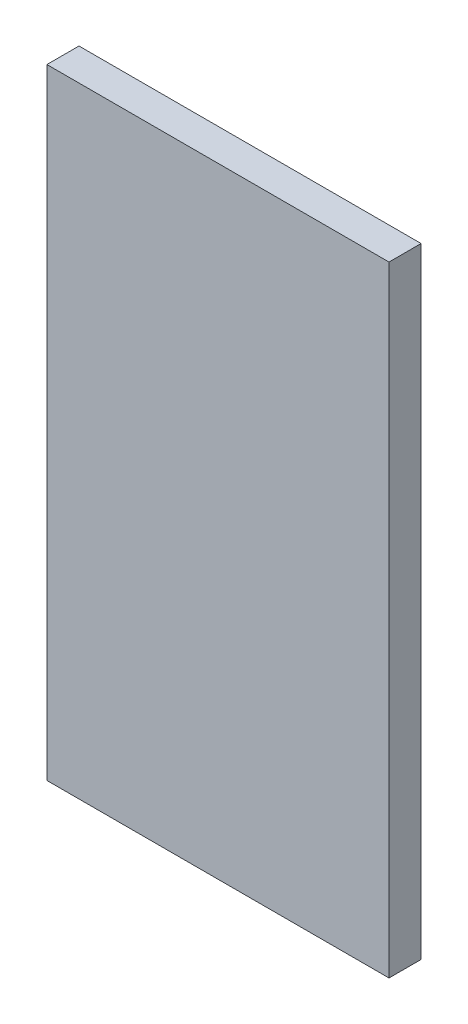
ISO-10303-21;
HEADER;
FILE_DESCRIPTION(('STEP AP214'),'2;1');
FILE_NAME('part.step','',(''),(''),'','','');
FILE_SCHEMA(('AUTOMOTIVE_DESIGN { 1 0 10303 214 1 1 1 1 }'));
ENDSEC;
DATA;
#1=APPLICATION_CONTEXT('core data for automotive mechanical design processes');
#2=APPLICATION_PROTOCOL_DEFINITION('international standard','automotive_design',2000,#1);
#3=PRODUCT_CONTEXT('',#1,'mechanical');
#4=PRODUCT('Part','Part','',(#3));
#5=PRODUCT_RELATED_PRODUCT_CATEGORY('part','',(#4));
#6=PRODUCT_DEFINITION_FORMATION('','',#4);
#7=PRODUCT_DEFINITION_CONTEXT('part definition',#1,'design');
#8=PRODUCT_DEFINITION('design','',#6,#7);
#9=PRODUCT_DEFINITION_SHAPE('','',#8);
#10=(LENGTH_UNIT() NAMED_UNIT(*) SI_UNIT(.MILLI.,.METRE.));
#11=(NAMED_UNIT(*) PLANE_ANGLE_UNIT() SI_UNIT($,.RADIAN.));
#12=(NAMED_UNIT(*) SI_UNIT($,.STERADIAN.) SOLID_ANGLE_UNIT());
#13=UNCERTAINTY_MEASURE_WITH_UNIT(LENGTH_MEASURE(1.E-05),#10,'distance_accuracy_value','');
#14=(GEOMETRIC_REPRESENTATION_CONTEXT(3) GLOBAL_UNCERTAINTY_ASSIGNED_CONTEXT((#13)) GLOBAL_UNIT_ASSIGNED_CONTEXT((#10,
#11,#12)) REPRESENTATION_CONTEXT('',''));
#15=CARTESIAN_POINT('',(0.,0.,0.));
#16=DIRECTION('',(0.,0.,1.));
#17=DIRECTION('',(1.,0.,0.));
#18=AXIS2_PLACEMENT_3D('',#15,#16,#17);
#19=CARTESIAN_POINT('',(0.,0.,3.));
#20=DIRECTION('',(1.,0.,0.));
#21=DIRECTION('',(0.,0.,-1.));
#22=AXIS2_PLACEMENT_3D('',#19,#20,#21);
#23=PLANE('',#22);
#24=DIRECTION('',(0.,-1.,0.));
#25=VECTOR('',#24,1.);
#26=CARTESIAN_POINT('',(0.,0.,0.));
#27=LINE('',#26,#25);
#28=CARTESIAN_POINT('',(0.,0.,0.));
#29=VERTEX_POINT('',#28);
#30=CARTESIAN_POINT('',(0.,-58.,0.));
#31=VERTEX_POINT('',#30);
#32=EDGE_CURVE('E96',#29,#31,#27,.T.);
#33=ORIENTED_EDGE('',*,*,#32,.T.);
#34=DIRECTION('',(0.,0.,-1.));
#35=VECTOR('',#34,1.);
#36=CARTESIAN_POINT('',(0.,-58.,3.));
#37=LINE('',#36,#35);
#38=CARTESIAN_POINT('',(0.,-58.,3.));
#39=VERTEX_POINT('',#38);
#40=EDGE_CURVE('E11',#39,#31,#37,.T.);
#41=ORIENTED_EDGE('',*,*,#40,.F.);
#42=DIRECTION('',(0.,-1.,0.));
#43=VECTOR('',#42,1.);
#44=CARTESIAN_POINT('',(0.,0.,3.));
#45=LINE('',#44,#43);
#46=CARTESIAN_POINT('',(0.,0.,3.));
#47=VERTEX_POINT('',#46);
#48=EDGE_CURVE('E84',#47,#39,#45,.T.);
#49=ORIENTED_EDGE('',*,*,#48,.F.);
#50=DIRECTION('',(0.,0.,-1.));
#51=VECTOR('',#50,1.);
#52=CARTESIAN_POINT('',(0.,0.,3.));
#53=LINE('',#52,#51);
#54=EDGE_CURVE('E92',#47,#29,#53,.T.);
#55=ORIENTED_EDGE('',*,*,#54,.T.);
#56=EDGE_LOOP('',(#33,#41,#49,#55));
#57=FACE_BOUND('',#56,.T.);
#58=ADVANCED_FACE('F33',(#57),#23,.F.);
#59=CARTESIAN_POINT('',(0.,-58.,3.));
#60=DIRECTION('',(0.,1.,0.));
#61=DIRECTION('',(0.,0.,1.));
#62=AXIS2_PLACEMENT_3D('',#59,#60,#61);
#63=PLANE('',#62);
#64=DIRECTION('',(1.,0.,0.));
#65=VECTOR('',#64,1.);
#66=CARTESIAN_POINT('',(0.,-58.,0.));
#67=LINE('',#66,#65);
#68=CARTESIAN_POINT('',(32.,-58.,0.));
#69=VERTEX_POINT('',#68);
#70=EDGE_CURVE('E88',#31,#69,#67,.T.);
#71=ORIENTED_EDGE('',*,*,#70,.T.);
#72=DIRECTION('',(0.,0.,-1.));
#73=VECTOR('',#72,1.);
#74=CARTESIAN_POINT('',(32.,-58.,3.));
#75=LINE('',#74,#73);
#76=CARTESIAN_POINT('',(32.,-58.,3.));
#77=VERTEX_POINT('',#76);
#78=EDGE_CURVE('E41',#77,#69,#75,.T.);
#79=ORIENTED_EDGE('',*,*,#78,.F.);
#80=DIRECTION('',(1.,0.,0.));
#81=VECTOR('',#80,1.);
#82=CARTESIAN_POINT('',(0.,-58.,3.));
#83=LINE('',#82,#81);
#84=EDGE_CURVE('E79',#39,#77,#83,.T.);
#85=ORIENTED_EDGE('',*,*,#84,.F.);
#86=ORIENTED_EDGE('',*,*,#40,.T.);
#87=EDGE_LOOP('',(#71,#79,#85,#86));
#88=FACE_BOUND('',#87,.T.);
#89=ADVANCED_FACE('F87',(#88),#63,.F.);
#90=CARTESIAN_POINT('',(32.,0.,3.));
#91=DIRECTION('',(-1.,0.,0.));
#92=DIRECTION('',(0.,-1.,0.));
#93=AXIS2_PLACEMENT_3D('',#90,#91,#92);
#94=PLANE('',#93);
#95=DIRECTION('',(0.,1.,0.));
#96=VECTOR('',#95,1.);
#97=CARTESIAN_POINT('',(32.,0.,0.));
#98=LINE('',#97,#96);
#99=CARTESIAN_POINT('',(32.,0.,0.));
#100=VERTEX_POINT('',#99);
#101=EDGE_CURVE('E66',#69,#100,#98,.T.);
#102=ORIENTED_EDGE('',*,*,#101,.T.);
#103=DIRECTION('',(0.,0.,-1.));
#104=VECTOR('',#103,1.);
#105=CARTESIAN_POINT('',(32.,0.,3.));
#106=LINE('',#105,#104);
#107=CARTESIAN_POINT('',(32.,0.,3.));
#108=VERTEX_POINT('',#107);
#109=EDGE_CURVE('E89',#108,#100,#106,.T.);
#110=ORIENTED_EDGE('',*,*,#109,.F.);
#111=DIRECTION('',(0.,1.,0.));
#112=VECTOR('',#111,1.);
#113=CARTESIAN_POINT('',(32.,0.,3.));
#114=LINE('',#113,#112);
#115=EDGE_CURVE('E82',#77,#108,#114,.T.);
#116=ORIENTED_EDGE('',*,*,#115,.F.);
#117=ORIENTED_EDGE('',*,*,#78,.T.);
#118=EDGE_LOOP('',(#102,#110,#116,#117));
#119=FACE_BOUND('',#118,.T.);
#120=ADVANCED_FACE('F90',(#119),#94,.F.);
#121=CARTESIAN_POINT('',(0.,0.,3.));
#122=DIRECTION('',(0.,-1.,0.));
#123=DIRECTION('',(0.,0.,-1.));
#124=AXIS2_PLACEMENT_3D('',#121,#122,#123);
#125=PLANE('',#124);
#126=DIRECTION('',(-1.,0.,0.));
#127=VECTOR('',#126,1.);
#128=CARTESIAN_POINT('',(0.,0.,0.));
#129=LINE('',#128,#127);
#130=EDGE_CURVE('E72',#100,#29,#129,.T.);
#131=ORIENTED_EDGE('',*,*,#130,.T.);
#132=ORIENTED_EDGE('',*,*,#54,.F.);
#133=DIRECTION('',(-1.,0.,0.));
#134=VECTOR('',#133,1.);
#135=CARTESIAN_POINT('',(0.,0.,3.));
#136=LINE('',#135,#134);
#137=EDGE_CURVE('E49',#108,#47,#136,.T.);
#138=ORIENTED_EDGE('',*,*,#137,.F.);
#139=ORIENTED_EDGE('',*,*,#109,.T.);
#140=EDGE_LOOP('',(#131,#132,#138,#139));
#141=FACE_BOUND('',#140,.T.);
#142=ADVANCED_FACE('F103',(#141),#125,.F.);
#143=CARTESIAN_POINT('',(0.,0.,3.));
#144=DIRECTION('',(0.,0.,1.));
#145=DIRECTION('',(1.,0.,0.));
#146=AXIS2_PLACEMENT_3D('',#143,#144,#145);
#147=PLANE('',#146);
#148=ORIENTED_EDGE('',*,*,#48,.T.);
#149=ORIENTED_EDGE('',*,*,#84,.T.);
#150=ORIENTED_EDGE('',*,*,#115,.T.);
#151=ORIENTED_EDGE('',*,*,#137,.T.);
#152=EDGE_LOOP('',(#148,#149,#150,#151));
#153=FACE_BOUND('',#152,.T.);
#154=ADVANCED_FACE('F80',(#153),#147,.T.);
#155=CARTESIAN_POINT('',(0.,0.,0.));
#156=DIRECTION('',(0.,0.,1.));
#157=DIRECTION('',(1.,0.,0.));
#158=AXIS2_PLACEMENT_3D('',#155,#156,#157);
#159=PLANE('',#158);
#160=ORIENTED_EDGE('',*,*,#32,.F.);
#161=ORIENTED_EDGE('',*,*,#130,.F.);
#162=ORIENTED_EDGE('',*,*,#101,.F.);
#163=ORIENTED_EDGE('',*,*,#70,.F.);
#164=EDGE_LOOP('',(#160,#161,#162,#163));
#165=FACE_BOUND('',#164,.T.);
#166=ADVANCED_FACE('F106',(#165),#159,.F.);
#167=CLOSED_SHELL('',(#58,#89,#120,#142,#154,#166));
#168=MANIFOLD_SOLID_BREP('B2',#167);
#169=ADVANCED_BREP_SHAPE_REPRESENTATION('',(#18,#168),#14);
#170=SHAPE_DEFINITION_REPRESENTATION(#9,#169);
ENDSEC;
END-ISO-10303-21;
